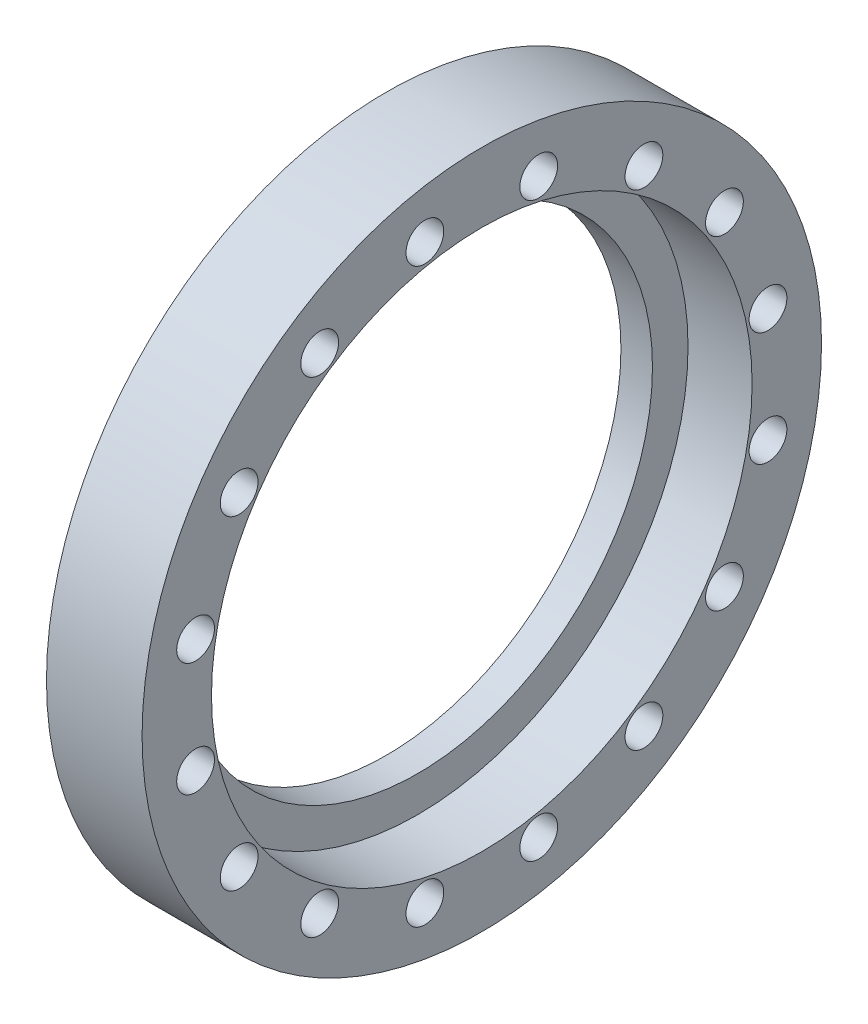
ISO-10303-21;
HEADER;
FILE_DESCRIPTION(('STEP AP214'),'2;1');
FILE_NAME('part.step','',(''),(''),'','','');
FILE_SCHEMA(('AUTOMOTIVE_DESIGN { 1 0 10303 214 1 1 1 1 }'));
ENDSEC;
DATA;
#1=APPLICATION_CONTEXT('core data for automotive mechanical design processes');
#2=APPLICATION_PROTOCOL_DEFINITION('international standard','automotive_design',2000,#1);
#3=PRODUCT_CONTEXT('',#1,'mechanical');
#4=PRODUCT('Part','Part','',(#3));
#5=PRODUCT_RELATED_PRODUCT_CATEGORY('part','',(#4));
#6=PRODUCT_DEFINITION_FORMATION('','',#4);
#7=PRODUCT_DEFINITION_CONTEXT('part definition',#1,'design');
#8=PRODUCT_DEFINITION('design','',#6,#7);
#9=PRODUCT_DEFINITION_SHAPE('','',#8);
#10=(LENGTH_UNIT() NAMED_UNIT(*) SI_UNIT(.MILLI.,.METRE.));
#11=(NAMED_UNIT(*) PLANE_ANGLE_UNIT() SI_UNIT($,.RADIAN.));
#12=(NAMED_UNIT(*) SI_UNIT($,.STERADIAN.) SOLID_ANGLE_UNIT());
#13=UNCERTAINTY_MEASURE_WITH_UNIT(LENGTH_MEASURE(1.E-05),#10,'distance_accuracy_value','');
#14=(GEOMETRIC_REPRESENTATION_CONTEXT(3) GLOBAL_UNCERTAINTY_ASSIGNED_CONTEXT((#13)) GLOBAL_UNIT_ASSIGNED_CONTEXT((#10,
#11,#12)) REPRESENTATION_CONTEXT('',''));
#15=CARTESIAN_POINT('',(0.,0.,0.));
#16=DIRECTION('',(0.,0.,1.));
#17=DIRECTION('',(1.,0.,0.));
#18=AXIS2_PLACEMENT_3D('',#15,#16,#17);
#19=CARTESIAN_POINT('',(7.03579999999964,56.35625,0.));
#20=DIRECTION('',(1.,0.,0.));
#21=DIRECTION('',(0.,0.,-1.));
#22=AXIS2_PLACEMENT_3D('',#19,#20,#21);
#23=PLANE('',#22);
#24=CARTESIAN_POINT('',(7.03579999999964,0.,0.));
#25=DIRECTION('',(1.,0.,0.));
#26=DIRECTION('',(0.,0.,-1.));
#27=AXIS2_PLACEMENT_3D('',#24,#25,#26);
#28=CIRCLE('',#27,52.3875);
#29=CARTESIAN_POINT('',(7.03579999999964,0.,-52.3875));
#30=VERTEX_POINT('',#29);
#31=EDGE_CURVE('E131',#30,#30,#28,.F.);
#32=ORIENTED_EDGE('',*,*,#31,.T.);
#33=EDGE_LOOP('',(#32));
#34=FACE_BOUND('',#33,.T.);
#35=CARTESIAN_POINT('',(7.03579999999964,0.,0.));
#36=DIRECTION('',(1.,0.,0.));
#37=DIRECTION('',(0.,0.,-1.));
#38=AXIS2_PLACEMENT_3D('',#35,#36,#37);
#39=CIRCLE('',#38,60.325);
#40=CARTESIAN_POINT('',(7.03579999999964,0.,-60.325));
#41=VERTEX_POINT('',#40);
#42=EDGE_CURVE('E19',#41,#41,#39,.T.);
#43=ORIENTED_EDGE('',*,*,#42,.T.);
#44=EDGE_LOOP('',(#43));
#45=FACE_BOUND('',#44,.T.);
#46=ADVANCED_FACE('F15',(#34,#45),#23,.T.);
#47=CARTESIAN_POINT('',(14.1858999999995,0.,0.));
#48=DIRECTION('',(1.,0.,0.));
#49=DIRECTION('',(0.,0.,-1.));
#50=AXIS2_PLACEMENT_3D('',#47,#48,#49);
#51=CYLINDRICAL_SURFACE('',#50,60.325);
#52=CARTESIAN_POINT('',(21.3359999999994,0.,0.));
#53=DIRECTION('',(1.,0.,0.));
#54=DIRECTION('',(0.,0.,-1.));
#55=AXIS2_PLACEMENT_3D('',#52,#53,#54);
#56=CIRCLE('',#55,60.325);
#57=CARTESIAN_POINT('',(21.3359999999994,0.,-60.325));
#58=VERTEX_POINT('',#57);
#59=EDGE_CURVE('E81',#58,#58,#56,.F.);
#60=ORIENTED_EDGE('',*,*,#59,.F.);
#61=EDGE_LOOP('',(#60));
#62=FACE_BOUND('',#61,.T.);
#63=ORIENTED_EDGE('',*,*,#42,.F.);
#64=EDGE_LOOP('',(#63));
#65=FACE_BOUND('',#64,.T.);
#66=ADVANCED_FACE('F139',(#62,#65),#51,.F.);
#67=CARTESIAN_POINT('',(21.3359999999994,-36.1818447675414,-54.1499573829706));
#68=DIRECTION('',(-1.,0.,0.));
#69=DIRECTION('',(0.,0.,1.));
#70=AXIS2_PLACEMENT_3D('',#67,#68,#69);
#71=CYLINDRICAL_SURFACE('',#70,4.21639999999999);
#72=CARTESIAN_POINT('',(21.3359999999994,-36.1818447675414,-54.1499573829706));
#73=DIRECTION('',(-1.,0.,0.));
#74=DIRECTION('',(0.,0.,1.));
#75=AXIS2_PLACEMENT_3D('',#72,#73,#74);
#76=CIRCLE('',#75,4.21639999999999);
#77=CARTESIAN_POINT('',(21.3359999999994,-36.1818447675414,-49.9335573829707));
#78=VERTEX_POINT('',#77);
#79=EDGE_CURVE('E129',#78,#78,#76,.T.);
#80=ORIENTED_EDGE('',*,*,#79,.F.);
#81=EDGE_LOOP('',(#80));
#82=FACE_BOUND('',#81,.T.);
#83=CARTESIAN_POINT('',(0.,-36.1818447675414,-54.1499573829706));
#84=DIRECTION('',(-1.,0.,0.));
#85=DIRECTION('',(0.,0.,1.));
#86=AXIS2_PLACEMENT_3D('',#83,#84,#85);
#87=CIRCLE('',#86,4.21639999999999);
#88=CARTESIAN_POINT('',(0.,-36.1818447675414,-49.9335573829707));
#89=VERTEX_POINT('',#88);
#90=EDGE_CURVE('E78',#89,#89,#87,.F.);
#91=ORIENTED_EDGE('',*,*,#90,.F.);
#92=EDGE_LOOP('',(#91));
#93=FACE_BOUND('',#92,.T.);
#94=ADVANCED_FACE('F141',(#82,#93),#71,.F.);
#95=CARTESIAN_POINT('',(21.3359999999994,-54.1499573829707,-36.1818447675415));
#96=DIRECTION('',(-1.,0.,0.));
#97=DIRECTION('',(0.,0.,1.));
#98=AXIS2_PLACEMENT_3D('',#95,#96,#97);
#99=CYLINDRICAL_SURFACE('',#98,4.21640000000001);
#100=CARTESIAN_POINT('',(21.3359999999994,-54.1499573829707,-36.1818447675415));
#101=DIRECTION('',(-1.,0.,0.));
#102=DIRECTION('',(0.,0.,1.));
#103=AXIS2_PLACEMENT_3D('',#100,#101,#102);
#104=CIRCLE('',#103,4.21640000000001);
#105=CARTESIAN_POINT('',(21.3359999999994,-54.1499573829707,-31.9654447675414));
#106=VERTEX_POINT('',#105);
#107=EDGE_CURVE('E126',#106,#106,#104,.T.);
#108=ORIENTED_EDGE('',*,*,#107,.F.);
#109=EDGE_LOOP('',(#108));
#110=FACE_BOUND('',#109,.T.);
#111=CARTESIAN_POINT('',(0.,-54.1499573829707,-36.1818447675415));
#112=DIRECTION('',(-1.,0.,0.));
#113=DIRECTION('',(0.,0.,1.));
#114=AXIS2_PLACEMENT_3D('',#111,#112,#113);
#115=CIRCLE('',#114,4.21640000000001);
#116=CARTESIAN_POINT('',(0.,-54.1499573829707,-31.9654447675414));
#117=VERTEX_POINT('',#116);
#118=EDGE_CURVE('E75',#117,#117,#115,.F.);
#119=ORIENTED_EDGE('',*,*,#118,.F.);
#120=EDGE_LOOP('',(#119));
#121=FACE_BOUND('',#120,.T.);
#122=ADVANCED_FACE('F149',(#110,#121),#99,.F.);
#123=CARTESIAN_POINT('',(21.3359999999994,-63.8742298574286,-12.7053742754936));
#124=DIRECTION('',(-1.,0.,0.));
#125=DIRECTION('',(0.,0.,1.));
#126=AXIS2_PLACEMENT_3D('',#123,#124,#125);
#127=CYLINDRICAL_SURFACE('',#126,4.21639999999999);
#128=CARTESIAN_POINT('',(21.3359999999994,-63.8742298574286,-12.7053742754936));
#129=DIRECTION('',(-1.,0.,0.));
#130=DIRECTION('',(0.,0.,1.));
#131=AXIS2_PLACEMENT_3D('',#128,#129,#130);
#132=CIRCLE('',#131,4.21639999999999);
#133=CARTESIAN_POINT('',(21.3359999999994,-63.8742298574286,-8.48897427549359));
#134=VERTEX_POINT('',#133);
#135=EDGE_CURVE('E123',#134,#134,#132,.T.);
#136=ORIENTED_EDGE('',*,*,#135,.F.);
#137=EDGE_LOOP('',(#136));
#138=FACE_BOUND('',#137,.T.);
#139=CARTESIAN_POINT('',(0.,-63.8742298574286,-12.7053742754936));
#140=DIRECTION('',(-1.,0.,0.));
#141=DIRECTION('',(0.,0.,1.));
#142=AXIS2_PLACEMENT_3D('',#139,#140,#141);
#143=CIRCLE('',#142,4.21639999999999);
#144=CARTESIAN_POINT('',(0.,-63.8742298574286,-8.48897427549359));
#145=VERTEX_POINT('',#144);
#146=EDGE_CURVE('E72',#145,#145,#143,.F.);
#147=ORIENTED_EDGE('',*,*,#146,.F.);
#148=EDGE_LOOP('',(#147));
#149=FACE_BOUND('',#148,.T.);
#150=ADVANCED_FACE('F215',(#138,#149),#127,.F.);
#151=CARTESIAN_POINT('',(21.3359999999994,-63.8742298574286,12.7053742754936));
#152=DIRECTION('',(-1.,0.,0.));
#153=DIRECTION('',(0.,0.,1.));
#154=AXIS2_PLACEMENT_3D('',#151,#152,#153);
#155=CYLINDRICAL_SURFACE('',#154,4.2164);
#156=CARTESIAN_POINT('',(21.3359999999994,-63.8742298574286,12.7053742754936));
#157=DIRECTION('',(-1.,0.,0.));
#158=DIRECTION('',(0.,0.,1.));
#159=AXIS2_PLACEMENT_3D('',#156,#157,#158);
#160=CIRCLE('',#159,4.2164);
#161=CARTESIAN_POINT('',(21.3359999999994,-63.8742298574286,16.9217742754936));
#162=VERTEX_POINT('',#161);
#163=EDGE_CURVE('E120',#162,#162,#160,.T.);
#164=ORIENTED_EDGE('',*,*,#163,.F.);
#165=EDGE_LOOP('',(#164));
#166=FACE_BOUND('',#165,.T.);
#167=CARTESIAN_POINT('',(0.,-63.8742298574286,12.7053742754936));
#168=DIRECTION('',(-1.,0.,0.));
#169=DIRECTION('',(0.,0.,1.));
#170=AXIS2_PLACEMENT_3D('',#167,#168,#169);
#171=CIRCLE('',#170,4.2164);
#172=CARTESIAN_POINT('',(0.,-63.8742298574286,16.9217742754936));
#173=VERTEX_POINT('',#172);
#174=EDGE_CURVE('E69',#173,#173,#171,.F.);
#175=ORIENTED_EDGE('',*,*,#174,.F.);
#176=EDGE_LOOP('',(#175));
#177=FACE_BOUND('',#176,.T.);
#178=ADVANCED_FACE('F221',(#166,#177),#155,.F.);
#179=CARTESIAN_POINT('',(21.3359999999994,-54.1499573829707,36.1818447675414));
#180=DIRECTION('',(-1.,0.,0.));
#181=DIRECTION('',(0.,0.,1.));
#182=AXIS2_PLACEMENT_3D('',#179,#180,#181);
#183=CYLINDRICAL_SURFACE('',#182,4.2164);
#184=CARTESIAN_POINT('',(21.3359999999994,-54.1499573829707,36.1818447675414));
#185=DIRECTION('',(-1.,0.,0.));
#186=DIRECTION('',(0.,0.,1.));
#187=AXIS2_PLACEMENT_3D('',#184,#185,#186);
#188=CIRCLE('',#187,4.2164);
#189=CARTESIAN_POINT('',(21.3359999999994,-54.1499573829707,40.3982447675414));
#190=VERTEX_POINT('',#189);
#191=EDGE_CURVE('E117',#190,#190,#188,.T.);
#192=ORIENTED_EDGE('',*,*,#191,.F.);
#193=EDGE_LOOP('',(#192));
#194=FACE_BOUND('',#193,.T.);
#195=CARTESIAN_POINT('',(0.,-54.1499573829707,36.1818447675414));
#196=DIRECTION('',(-1.,0.,0.));
#197=DIRECTION('',(0.,0.,1.));
#198=AXIS2_PLACEMENT_3D('',#195,#196,#197);
#199=CIRCLE('',#198,4.2164);
#200=CARTESIAN_POINT('',(0.,-54.1499573829707,40.3982447675414));
#201=VERTEX_POINT('',#200);
#202=EDGE_CURVE('E66',#201,#201,#199,.F.);
#203=ORIENTED_EDGE('',*,*,#202,.F.);
#204=EDGE_LOOP('',(#203));
#205=FACE_BOUND('',#204,.T.);
#206=ADVANCED_FACE('F228',(#194,#205),#183,.F.);
#207=CARTESIAN_POINT('',(21.3359999999994,-36.1818447675414,54.1499573829706));
#208=DIRECTION('',(-1.,0.,0.));
#209=DIRECTION('',(0.,0.,1.));
#210=AXIS2_PLACEMENT_3D('',#207,#208,#209);
#211=CYLINDRICAL_SURFACE('',#210,4.21640000000001);
#212=CARTESIAN_POINT('',(21.3359999999994,-36.1818447675414,54.1499573829706));
#213=DIRECTION('',(-1.,0.,0.));
#214=DIRECTION('',(0.,0.,1.));
#215=AXIS2_PLACEMENT_3D('',#212,#213,#214);
#216=CIRCLE('',#215,4.21640000000001);
#217=CARTESIAN_POINT('',(21.3359999999994,-36.1818447675414,58.3663573829707));
#218=VERTEX_POINT('',#217);
#219=EDGE_CURVE('E114',#218,#218,#216,.T.);
#220=ORIENTED_EDGE('',*,*,#219,.F.);
#221=EDGE_LOOP('',(#220));
#222=FACE_BOUND('',#221,.T.);
#223=CARTESIAN_POINT('',(0.,-36.1818447675414,54.1499573829706));
#224=DIRECTION('',(-1.,0.,0.));
#225=DIRECTION('',(0.,0.,1.));
#226=AXIS2_PLACEMENT_3D('',#223,#224,#225);
#227=CIRCLE('',#226,4.21640000000001);
#228=CARTESIAN_POINT('',(0.,-36.1818447675414,58.3663573829707));
#229=VERTEX_POINT('',#228);
#230=EDGE_CURVE('E63',#229,#229,#227,.F.);
#231=ORIENTED_EDGE('',*,*,#230,.F.);
#232=EDGE_LOOP('',(#231));
#233=FACE_BOUND('',#232,.T.);
#234=ADVANCED_FACE('F232',(#222,#233),#211,.F.);
#235=CARTESIAN_POINT('',(21.3359999999994,-12.7053742754936,63.8742298574286));
#236=DIRECTION('',(-1.,0.,0.));
#237=DIRECTION('',(0.,0.,1.));
#238=AXIS2_PLACEMENT_3D('',#235,#236,#237);
#239=CYLINDRICAL_SURFACE('',#238,4.21639999999999);
#240=CARTESIAN_POINT('',(21.3359999999994,-12.7053742754936,63.8742298574286));
#241=DIRECTION('',(-1.,0.,0.));
#242=DIRECTION('',(0.,0.,1.));
#243=AXIS2_PLACEMENT_3D('',#240,#241,#242);
#244=CIRCLE('',#243,4.21639999999999);
#245=CARTESIAN_POINT('',(21.3359999999994,-12.7053742754936,68.0906298574286));
#246=VERTEX_POINT('',#245);
#247=EDGE_CURVE('E111',#246,#246,#244,.T.);
#248=ORIENTED_EDGE('',*,*,#247,.F.);
#249=EDGE_LOOP('',(#248));
#250=FACE_BOUND('',#249,.T.);
#251=CARTESIAN_POINT('',(0.,-12.7053742754936,63.8742298574286));
#252=DIRECTION('',(-1.,0.,0.));
#253=DIRECTION('',(0.,0.,1.));
#254=AXIS2_PLACEMENT_3D('',#251,#252,#253);
#255=CIRCLE('',#254,4.21639999999999);
#256=CARTESIAN_POINT('',(0.,-12.7053742754936,68.0906298574286));
#257=VERTEX_POINT('',#256);
#258=EDGE_CURVE('E60',#257,#257,#255,.F.);
#259=ORIENTED_EDGE('',*,*,#258,.F.);
#260=EDGE_LOOP('',(#259));
#261=FACE_BOUND('',#260,.T.);
#262=ADVANCED_FACE('F236',(#250,#261),#239,.F.);
#263=CARTESIAN_POINT('',(21.3359999999994,12.7053742754935,63.8742298574287));
#264=DIRECTION('',(-1.,0.,0.));
#265=DIRECTION('',(0.,0.,1.));
#266=AXIS2_PLACEMENT_3D('',#263,#264,#265);
#267=CYLINDRICAL_SURFACE('',#266,4.21640000000001);
#268=CARTESIAN_POINT('',(21.3359999999994,12.7053742754935,63.8742298574287));
#269=DIRECTION('',(-1.,0.,0.));
#270=DIRECTION('',(0.,0.,1.));
#271=AXIS2_PLACEMENT_3D('',#268,#269,#270);
#272=CIRCLE('',#271,4.21640000000001);
#273=CARTESIAN_POINT('',(21.3359999999994,12.7053742754935,68.0906298574287));
#274=VERTEX_POINT('',#273);
#275=EDGE_CURVE('E108',#274,#274,#272,.T.);
#276=ORIENTED_EDGE('',*,*,#275,.F.);
#277=EDGE_LOOP('',(#276));
#278=FACE_BOUND('',#277,.T.);
#279=CARTESIAN_POINT('',(0.,12.7053742754935,63.8742298574287));
#280=DIRECTION('',(-1.,0.,0.));
#281=DIRECTION('',(0.,0.,1.));
#282=AXIS2_PLACEMENT_3D('',#279,#280,#281);
#283=CIRCLE('',#282,4.21640000000001);
#284=CARTESIAN_POINT('',(0.,12.7053742754935,68.0906298574287));
#285=VERTEX_POINT('',#284);
#286=EDGE_CURVE('E57',#285,#285,#283,.F.);
#287=ORIENTED_EDGE('',*,*,#286,.F.);
#288=EDGE_LOOP('',(#287));
#289=FACE_BOUND('',#288,.T.);
#290=ADVANCED_FACE('F240',(#278,#289),#267,.F.);
#291=CARTESIAN_POINT('',(21.3359999999994,36.1818447675414,54.1499573829707));
#292=DIRECTION('',(-1.,0.,0.));
#293=DIRECTION('',(0.,0.,1.));
#294=AXIS2_PLACEMENT_3D('',#291,#292,#293);
#295=CYLINDRICAL_SURFACE('',#294,4.2164);
#296=CARTESIAN_POINT('',(21.3359999999994,36.1818447675414,54.1499573829707));
#297=DIRECTION('',(-1.,0.,0.));
#298=DIRECTION('',(0.,0.,1.));
#299=AXIS2_PLACEMENT_3D('',#296,#297,#298);
#300=CIRCLE('',#299,4.2164);
#301=CARTESIAN_POINT('',(21.3359999999994,36.1818447675414,58.3663573829707));
#302=VERTEX_POINT('',#301);
#303=EDGE_CURVE('E105',#302,#302,#300,.T.);
#304=ORIENTED_EDGE('',*,*,#303,.F.);
#305=EDGE_LOOP('',(#304));
#306=FACE_BOUND('',#305,.T.);
#307=CARTESIAN_POINT('',(0.,36.1818447675414,54.1499573829707));
#308=DIRECTION('',(-1.,0.,0.));
#309=DIRECTION('',(0.,0.,1.));
#310=AXIS2_PLACEMENT_3D('',#307,#308,#309);
#311=CIRCLE('',#310,4.2164);
#312=CARTESIAN_POINT('',(0.,36.1818447675414,58.3663573829707));
#313=VERTEX_POINT('',#312);
#314=EDGE_CURVE('E54',#313,#313,#311,.F.);
#315=ORIENTED_EDGE('',*,*,#314,.F.);
#316=EDGE_LOOP('',(#315));
#317=FACE_BOUND('',#316,.T.);
#318=ADVANCED_FACE('F244',(#306,#317),#295,.F.);
#319=CARTESIAN_POINT('',(21.3359999999994,54.1499573829707,36.1818447675415));
#320=DIRECTION('',(-1.,0.,0.));
#321=DIRECTION('',(0.,0.,1.));
#322=AXIS2_PLACEMENT_3D('',#319,#320,#321);
#323=CYLINDRICAL_SURFACE('',#322,4.21640000000001);
#324=CARTESIAN_POINT('',(21.3359999999994,54.1499573829707,36.1818447675415));
#325=DIRECTION('',(-1.,0.,0.));
#326=DIRECTION('',(0.,0.,1.));
#327=AXIS2_PLACEMENT_3D('',#324,#325,#326);
#328=CIRCLE('',#327,4.21640000000001);
#329=CARTESIAN_POINT('',(21.3359999999994,54.1499573829707,40.3982447675415));
#330=VERTEX_POINT('',#329);
#331=EDGE_CURVE('E102',#330,#330,#328,.T.);
#332=ORIENTED_EDGE('',*,*,#331,.F.);
#333=EDGE_LOOP('',(#332));
#334=FACE_BOUND('',#333,.T.);
#335=CARTESIAN_POINT('',(0.,54.1499573829707,36.1818447675415));
#336=DIRECTION('',(-1.,0.,0.));
#337=DIRECTION('',(0.,0.,1.));
#338=AXIS2_PLACEMENT_3D('',#335,#336,#337);
#339=CIRCLE('',#338,4.21640000000001);
#340=CARTESIAN_POINT('',(0.,54.1499573829707,40.3982447675415));
#341=VERTEX_POINT('',#340);
#342=EDGE_CURVE('E51',#341,#341,#339,.F.);
#343=ORIENTED_EDGE('',*,*,#342,.F.);
#344=EDGE_LOOP('',(#343));
#345=FACE_BOUND('',#344,.T.);
#346=ADVANCED_FACE('F248',(#334,#345),#323,.F.);
#347=CARTESIAN_POINT('',(21.3359999999994,63.8742298574286,12.7053742754936));
#348=DIRECTION('',(-1.,0.,0.));
#349=DIRECTION('',(0.,0.,1.));
#350=AXIS2_PLACEMENT_3D('',#347,#348,#349);
#351=CYLINDRICAL_SURFACE('',#350,4.21639999999999);
#352=CARTESIAN_POINT('',(21.3359999999994,63.8742298574286,12.7053742754936));
#353=DIRECTION('',(-1.,0.,0.));
#354=DIRECTION('',(0.,0.,1.));
#355=AXIS2_PLACEMENT_3D('',#352,#353,#354);
#356=CIRCLE('',#355,4.21639999999999);
#357=CARTESIAN_POINT('',(21.3359999999994,63.8742298574286,16.9217742754936));
#358=VERTEX_POINT('',#357);
#359=EDGE_CURVE('E99',#358,#358,#356,.T.);
#360=ORIENTED_EDGE('',*,*,#359,.F.);
#361=EDGE_LOOP('',(#360));
#362=FACE_BOUND('',#361,.T.);
#363=CARTESIAN_POINT('',(0.,63.8742298574286,12.7053742754936));
#364=DIRECTION('',(-1.,0.,0.));
#365=DIRECTION('',(0.,0.,1.));
#366=AXIS2_PLACEMENT_3D('',#363,#364,#365);
#367=CIRCLE('',#366,4.21639999999999);
#368=CARTESIAN_POINT('',(0.,63.8742298574286,16.9217742754936));
#369=VERTEX_POINT('',#368);
#370=EDGE_CURVE('E48',#369,#369,#367,.F.);
#371=ORIENTED_EDGE('',*,*,#370,.F.);
#372=EDGE_LOOP('',(#371));
#373=FACE_BOUND('',#372,.T.);
#374=ADVANCED_FACE('F252',(#362,#373),#351,.F.);
#375=CARTESIAN_POINT('',(21.3359999999994,63.8742298574287,-12.7053742754935));
#376=DIRECTION('',(-1.,0.,0.));
#377=DIRECTION('',(0.,0.,1.));
#378=AXIS2_PLACEMENT_3D('',#375,#376,#377);
#379=CYLINDRICAL_SURFACE('',#378,4.21640000000001);
#380=CARTESIAN_POINT('',(21.3359999999994,63.8742298574287,-12.7053742754935));
#381=DIRECTION('',(-1.,0.,0.));
#382=DIRECTION('',(0.,0.,1.));
#383=AXIS2_PLACEMENT_3D('',#380,#381,#382);
#384=CIRCLE('',#383,4.21640000000001);
#385=CARTESIAN_POINT('',(21.3359999999994,63.8742298574287,-8.48897427549354));
#386=VERTEX_POINT('',#385);
#387=EDGE_CURVE('E96',#386,#386,#384,.T.);
#388=ORIENTED_EDGE('',*,*,#387,.F.);
#389=EDGE_LOOP('',(#388));
#390=FACE_BOUND('',#389,.T.);
#391=CARTESIAN_POINT('',(0.,63.8742298574287,-12.7053742754935));
#392=DIRECTION('',(-1.,0.,0.));
#393=DIRECTION('',(0.,0.,1.));
#394=AXIS2_PLACEMENT_3D('',#391,#392,#393);
#395=CIRCLE('',#394,4.21640000000001);
#396=CARTESIAN_POINT('',(0.,63.8742298574287,-8.48897427549354));
#397=VERTEX_POINT('',#396);
#398=EDGE_CURVE('E45',#397,#397,#395,.F.);
#399=ORIENTED_EDGE('',*,*,#398,.F.);
#400=EDGE_LOOP('',(#399));
#401=FACE_BOUND('',#400,.T.);
#402=ADVANCED_FACE('F256',(#390,#401),#379,.F.);
#403=CARTESIAN_POINT('',(21.3359999999994,54.1499573829707,-36.1818447675414));
#404=DIRECTION('',(-1.,0.,0.));
#405=DIRECTION('',(0.,0.,1.));
#406=AXIS2_PLACEMENT_3D('',#403,#404,#405);
#407=CYLINDRICAL_SURFACE('',#406,4.2164);
#408=CARTESIAN_POINT('',(21.3359999999994,54.1499573829707,-36.1818447675414));
#409=DIRECTION('',(-1.,0.,0.));
#410=DIRECTION('',(0.,0.,1.));
#411=AXIS2_PLACEMENT_3D('',#408,#409,#410);
#412=CIRCLE('',#411,4.2164);
#413=CARTESIAN_POINT('',(21.3359999999994,54.1499573829707,-31.9654447675414));
#414=VERTEX_POINT('',#413);
#415=EDGE_CURVE('E93',#414,#414,#412,.T.);
#416=ORIENTED_EDGE('',*,*,#415,.F.);
#417=EDGE_LOOP('',(#416));
#418=FACE_BOUND('',#417,.T.);
#419=CARTESIAN_POINT('',(0.,54.1499573829707,-36.1818447675414));
#420=DIRECTION('',(-1.,0.,0.));
#421=DIRECTION('',(0.,0.,1.));
#422=AXIS2_PLACEMENT_3D('',#419,#420,#421);
#423=CIRCLE('',#422,4.2164);
#424=CARTESIAN_POINT('',(0.,54.1499573829707,-31.9654447675414));
#425=VERTEX_POINT('',#424);
#426=EDGE_CURVE('E42',#425,#425,#423,.F.);
#427=ORIENTED_EDGE('',*,*,#426,.F.);
#428=EDGE_LOOP('',(#427));
#429=FACE_BOUND('',#428,.T.);
#430=ADVANCED_FACE('F260',(#418,#429),#407,.F.);
#431=CARTESIAN_POINT('',(21.3359999999994,36.1818447675414,-54.1499573829706));
#432=DIRECTION('',(-1.,0.,0.));
#433=DIRECTION('',(0.,0.,1.));
#434=AXIS2_PLACEMENT_3D('',#431,#432,#433);
#435=CYLINDRICAL_SURFACE('',#434,4.21639999999998);
#436=CARTESIAN_POINT('',(21.3359999999994,36.1818447675414,-54.1499573829706));
#437=DIRECTION('',(-1.,0.,0.));
#438=DIRECTION('',(0.,0.,1.));
#439=AXIS2_PLACEMENT_3D('',#436,#437,#438);
#440=CIRCLE('',#439,4.21639999999998);
#441=CARTESIAN_POINT('',(21.3359999999994,36.1818447675414,-49.9335573829706));
#442=VERTEX_POINT('',#441);
#443=EDGE_CURVE('E90',#442,#442,#440,.T.);
#444=ORIENTED_EDGE('',*,*,#443,.F.);
#445=EDGE_LOOP('',(#444));
#446=FACE_BOUND('',#445,.T.);
#447=CARTESIAN_POINT('',(0.,36.1818447675414,-54.1499573829706));
#448=DIRECTION('',(-1.,0.,0.));
#449=DIRECTION('',(0.,0.,1.));
#450=AXIS2_PLACEMENT_3D('',#447,#448,#449);
#451=CIRCLE('',#450,4.21639999999998);
#452=CARTESIAN_POINT('',(0.,36.1818447675414,-49.9335573829706));
#453=VERTEX_POINT('',#452);
#454=EDGE_CURVE('E39',#453,#453,#451,.F.);
#455=ORIENTED_EDGE('',*,*,#454,.F.);
#456=EDGE_LOOP('',(#455));
#457=FACE_BOUND('',#456,.T.);
#458=ADVANCED_FACE('F264',(#446,#457),#435,.F.);
#459=CARTESIAN_POINT('',(21.3359999999994,-12.7053742754936,-63.8742298574286));
#460=DIRECTION('',(-1.,0.,0.));
#461=DIRECTION('',(0.,0.,1.));
#462=AXIS2_PLACEMENT_3D('',#459,#460,#461);
#463=CYLINDRICAL_SURFACE('',#462,4.2164);
#464=CARTESIAN_POINT('',(21.3359999999994,-12.7053742754936,-63.8742298574286));
#465=DIRECTION('',(-1.,0.,0.));
#466=DIRECTION('',(0.,0.,1.));
#467=AXIS2_PLACEMENT_3D('',#464,#465,#466);
#468=CIRCLE('',#467,4.2164);
#469=CARTESIAN_POINT('',(21.3359999999994,-12.7053742754936,-59.6578298574286));
#470=VERTEX_POINT('',#469);
#471=EDGE_CURVE('E87',#470,#470,#468,.T.);
#472=ORIENTED_EDGE('',*,*,#471,.F.);
#473=EDGE_LOOP('',(#472));
#474=FACE_BOUND('',#473,.T.);
#475=CARTESIAN_POINT('',(0.,-12.7053742754936,-63.8742298574286));
#476=DIRECTION('',(-1.,0.,0.));
#477=DIRECTION('',(0.,0.,1.));
#478=AXIS2_PLACEMENT_3D('',#475,#476,#477);
#479=CIRCLE('',#478,4.2164);
#480=CARTESIAN_POINT('',(0.,-12.7053742754936,-59.6578298574286));
#481=VERTEX_POINT('',#480);
#482=EDGE_CURVE('E36',#481,#481,#479,.F.);
#483=ORIENTED_EDGE('',*,*,#482,.F.);
#484=EDGE_LOOP('',(#483));
#485=FACE_BOUND('',#484,.T.);
#486=ADVANCED_FACE('F175',(#474,#485),#463,.F.);
#487=CARTESIAN_POINT('',(21.3359999999994,12.7053742754936,-63.8742298574286));
#488=DIRECTION('',(-1.,0.,0.));
#489=DIRECTION('',(0.,0.,1.));
#490=AXIS2_PLACEMENT_3D('',#487,#488,#489);
#491=CYLINDRICAL_SURFACE('',#490,4.21639999999999);
#492=CARTESIAN_POINT('',(21.3359999999994,12.7053742754936,-63.8742298574286));
#493=DIRECTION('',(-1.,0.,0.));
#494=DIRECTION('',(0.,0.,1.));
#495=AXIS2_PLACEMENT_3D('',#492,#493,#494);
#496=CIRCLE('',#495,4.21639999999999);
#497=CARTESIAN_POINT('',(21.3359999999994,12.7053742754936,-59.6578298574286));
#498=VERTEX_POINT('',#497);
#499=EDGE_CURVE('E84',#498,#498,#496,.T.);
#500=ORIENTED_EDGE('',*,*,#499,.F.);
#501=EDGE_LOOP('',(#500));
#502=FACE_BOUND('',#501,.T.);
#503=CARTESIAN_POINT('',(0.,12.7053742754936,-63.8742298574286));
#504=DIRECTION('',(-1.,0.,0.));
#505=DIRECTION('',(0.,0.,1.));
#506=AXIS2_PLACEMENT_3D('',#503,#504,#505);
#507=CIRCLE('',#506,4.21639999999999);
#508=CARTESIAN_POINT('',(0.,12.7053742754936,-59.6578298574286));
#509=VERTEX_POINT('',#508);
#510=EDGE_CURVE('E33',#509,#509,#507,.F.);
#511=ORIENTED_EDGE('',*,*,#510,.F.);
#512=EDGE_LOOP('',(#511));
#513=FACE_BOUND('',#512,.T.);
#514=ADVANCED_FACE('F17',(#502,#513),#491,.F.);
#515=CARTESIAN_POINT('',(3.51789999999982,0.,0.));
#516=DIRECTION('',(1.,0.,0.));
#517=DIRECTION('',(0.,0.,-1.));
#518=AXIS2_PLACEMENT_3D('',#515,#516,#517);
#519=CYLINDRICAL_SURFACE('',#518,52.3875);
#520=ORIENTED_EDGE('',*,*,#31,.F.);
#521=EDGE_LOOP('',(#520));
#522=FACE_BOUND('',#521,.T.);
#523=CARTESIAN_POINT('',(0.,0.,0.));
#524=DIRECTION('',(1.,0.,0.));
#525=DIRECTION('',(0.,0.,-1.));
#526=AXIS2_PLACEMENT_3D('',#523,#524,#525);
#527=CIRCLE('',#526,52.3875);
#528=CARTESIAN_POINT('',(0.,0.,-52.3875));
#529=VERTEX_POINT('',#528);
#530=EDGE_CURVE('E28',#529,#529,#527,.T.);
#531=ORIENTED_EDGE('',*,*,#530,.F.);
#532=EDGE_LOOP('',(#531));
#533=FACE_BOUND('',#532,.T.);
#534=ADVANCED_FACE('F168',(#522,#533),#519,.F.);
#535=CARTESIAN_POINT('',(21.3359999999994,68.0720000000002,0.));
#536=DIRECTION('',(1.,0.,0.));
#537=DIRECTION('',(0.,0.,-1.));
#538=AXIS2_PLACEMENT_3D('',#535,#536,#537);
#539=PLANE('',#538);
#540=ORIENTED_EDGE('',*,*,#59,.T.);
#541=EDGE_LOOP('',(#540));
#542=FACE_BOUND('',#541,.T.);
#543=ORIENTED_EDGE('',*,*,#499,.T.);
#544=EDGE_LOOP('',(#543));
#545=FACE_BOUND('',#544,.T.);
#546=ORIENTED_EDGE('',*,*,#471,.T.);
#547=EDGE_LOOP('',(#546));
#548=FACE_BOUND('',#547,.T.);
#549=ORIENTED_EDGE('',*,*,#443,.T.);
#550=EDGE_LOOP('',(#549));
#551=FACE_BOUND('',#550,.T.);
#552=ORIENTED_EDGE('',*,*,#415,.T.);
#553=EDGE_LOOP('',(#552));
#554=FACE_BOUND('',#553,.T.);
#555=ORIENTED_EDGE('',*,*,#387,.T.);
#556=EDGE_LOOP('',(#555));
#557=FACE_BOUND('',#556,.T.);
#558=ORIENTED_EDGE('',*,*,#359,.T.);
#559=EDGE_LOOP('',(#558));
#560=FACE_BOUND('',#559,.T.);
#561=ORIENTED_EDGE('',*,*,#331,.T.);
#562=EDGE_LOOP('',(#561));
#563=FACE_BOUND('',#562,.T.);
#564=ORIENTED_EDGE('',*,*,#303,.T.);
#565=EDGE_LOOP('',(#564));
#566=FACE_BOUND('',#565,.T.);
#567=ORIENTED_EDGE('',*,*,#275,.T.);
#568=EDGE_LOOP('',(#567));
#569=FACE_BOUND('',#568,.T.);
#570=ORIENTED_EDGE('',*,*,#247,.T.);
#571=EDGE_LOOP('',(#570));
#572=FACE_BOUND('',#571,.T.);
#573=ORIENTED_EDGE('',*,*,#219,.T.);
#574=EDGE_LOOP('',(#573));
#575=FACE_BOUND('',#574,.T.);
#576=ORIENTED_EDGE('',*,*,#191,.T.);
#577=EDGE_LOOP('',(#576));
#578=FACE_BOUND('',#577,.T.);
#579=ORIENTED_EDGE('',*,*,#163,.T.);
#580=EDGE_LOOP('',(#579));
#581=FACE_BOUND('',#580,.T.);
#582=ORIENTED_EDGE('',*,*,#135,.T.);
#583=EDGE_LOOP('',(#582));
#584=FACE_BOUND('',#583,.T.);
#585=ORIENTED_EDGE('',*,*,#107,.T.);
#586=EDGE_LOOP('',(#585));
#587=FACE_BOUND('',#586,.T.);
#588=ORIENTED_EDGE('',*,*,#79,.T.);
#589=EDGE_LOOP('',(#588));
#590=FACE_BOUND('',#589,.T.);
#591=CARTESIAN_POINT('',(21.3359999999994,0.,0.));
#592=DIRECTION('',(1.,0.,0.));
#593=DIRECTION('',(0.,0.,-1.));
#594=AXIS2_PLACEMENT_3D('',#591,#592,#593);
#595=CIRCLE('',#594,75.8190000000003);
#596=CARTESIAN_POINT('',(21.3359999999994,0.,-75.8190000000003));
#597=VERTEX_POINT('',#596);
#598=EDGE_CURVE('E23',#597,#597,#595,.F.);
#599=ORIENTED_EDGE('',*,*,#598,.F.);
#600=EDGE_LOOP('',(#599));
#601=FACE_BOUND('',#600,.T.);
#602=ADVANCED_FACE('F162',(#542,#545,#548,#551,#554,#557,#560,#563,#566,#569,#572,#575,#578,
#581,#584,#587,#590,#601),#539,.T.);
#603=CARTESIAN_POINT('',(0.,64.1032500000002,0.));
#604=DIRECTION('',(-1.,0.,0.));
#605=DIRECTION('',(0.,0.,1.));
#606=AXIS2_PLACEMENT_3D('',#603,#604,#605);
#607=PLANE('',#606);
#608=ORIENTED_EDGE('',*,*,#530,.T.);
#609=EDGE_LOOP('',(#608));
#610=FACE_BOUND('',#609,.T.);
#611=ORIENTED_EDGE('',*,*,#510,.T.);
#612=EDGE_LOOP('',(#611));
#613=FACE_BOUND('',#612,.T.);
#614=ORIENTED_EDGE('',*,*,#482,.T.);
#615=EDGE_LOOP('',(#614));
#616=FACE_BOUND('',#615,.T.);
#617=ORIENTED_EDGE('',*,*,#454,.T.);
#618=EDGE_LOOP('',(#617));
#619=FACE_BOUND('',#618,.T.);
#620=ORIENTED_EDGE('',*,*,#426,.T.);
#621=EDGE_LOOP('',(#620));
#622=FACE_BOUND('',#621,.T.);
#623=ORIENTED_EDGE('',*,*,#398,.T.);
#624=EDGE_LOOP('',(#623));
#625=FACE_BOUND('',#624,.T.);
#626=ORIENTED_EDGE('',*,*,#370,.T.);
#627=EDGE_LOOP('',(#626));
#628=FACE_BOUND('',#627,.T.);
#629=ORIENTED_EDGE('',*,*,#342,.T.);
#630=EDGE_LOOP('',(#629));
#631=FACE_BOUND('',#630,.T.);
#632=ORIENTED_EDGE('',*,*,#314,.T.);
#633=EDGE_LOOP('',(#632));
#634=FACE_BOUND('',#633,.T.);
#635=ORIENTED_EDGE('',*,*,#286,.T.);
#636=EDGE_LOOP('',(#635));
#637=FACE_BOUND('',#636,.T.);
#638=ORIENTED_EDGE('',*,*,#258,.T.);
#639=EDGE_LOOP('',(#638));
#640=FACE_BOUND('',#639,.T.);
#641=ORIENTED_EDGE('',*,*,#230,.T.);
#642=EDGE_LOOP('',(#641));
#643=FACE_BOUND('',#642,.T.);
#644=ORIENTED_EDGE('',*,*,#202,.T.);
#645=EDGE_LOOP('',(#644));
#646=FACE_BOUND('',#645,.T.);
#647=ORIENTED_EDGE('',*,*,#174,.T.);
#648=EDGE_LOOP('',(#647));
#649=FACE_BOUND('',#648,.T.);
#650=ORIENTED_EDGE('',*,*,#146,.T.);
#651=EDGE_LOOP('',(#650));
#652=FACE_BOUND('',#651,.T.);
#653=ORIENTED_EDGE('',*,*,#118,.T.);
#654=EDGE_LOOP('',(#653));
#655=FACE_BOUND('',#654,.T.);
#656=ORIENTED_EDGE('',*,*,#90,.T.);
#657=EDGE_LOOP('',(#656));
#658=FACE_BOUND('',#657,.T.);
#659=CARTESIAN_POINT('',(0.,0.,0.));
#660=DIRECTION('',(1.,0.,0.));
#661=DIRECTION('',(0.,0.,-1.));
#662=AXIS2_PLACEMENT_3D('',#659,#660,#661);
#663=CIRCLE('',#662,75.8190000000003);
#664=CARTESIAN_POINT('',(0.,0.,-75.8190000000003));
#665=VERTEX_POINT('',#664);
#666=EDGE_CURVE('E10',#665,#665,#663,.T.);
#667=ORIENTED_EDGE('',*,*,#666,.F.);
#668=EDGE_LOOP('',(#667));
#669=FACE_BOUND('',#668,.T.);
#670=ADVANCED_FACE('F157',(#610,#613,#616,#619,#622,#625,#628,#631,#634,#637,#640,#643,#646,
#649,#652,#655,#658,#669),#607,.T.);
#671=CARTESIAN_POINT('',(10.6679999999997,0.,0.));
#672=DIRECTION('',(1.,0.,0.));
#673=DIRECTION('',(0.,0.,-1.));
#674=AXIS2_PLACEMENT_3D('',#671,#672,#673);
#675=CYLINDRICAL_SURFACE('',#674,75.8190000000003);
#676=ORIENTED_EDGE('',*,*,#666,.T.);
#677=EDGE_LOOP('',(#676));
#678=FACE_BOUND('',#677,.T.);
#679=ORIENTED_EDGE('',*,*,#598,.T.);
#680=EDGE_LOOP('',(#679));
#681=FACE_BOUND('',#680,.T.);
#682=ADVANCED_FACE('F155',(#678,#681),#675,.T.);
#683=CLOSED_SHELL('',(#46,#66,#94,#122,#150,#178,#206,#234,#262,#290,#318,#346,#374,#402,#430,
#458,#486,#514,#534,#602,#670,#682));
#684=MANIFOLD_SOLID_BREP('B1',#683);
#685=ADVANCED_BREP_SHAPE_REPRESENTATION('',(#18,#684),#14);
#686=SHAPE_DEFINITION_REPRESENTATION(#9,#685);
ENDSEC;
END-ISO-10303-21;
